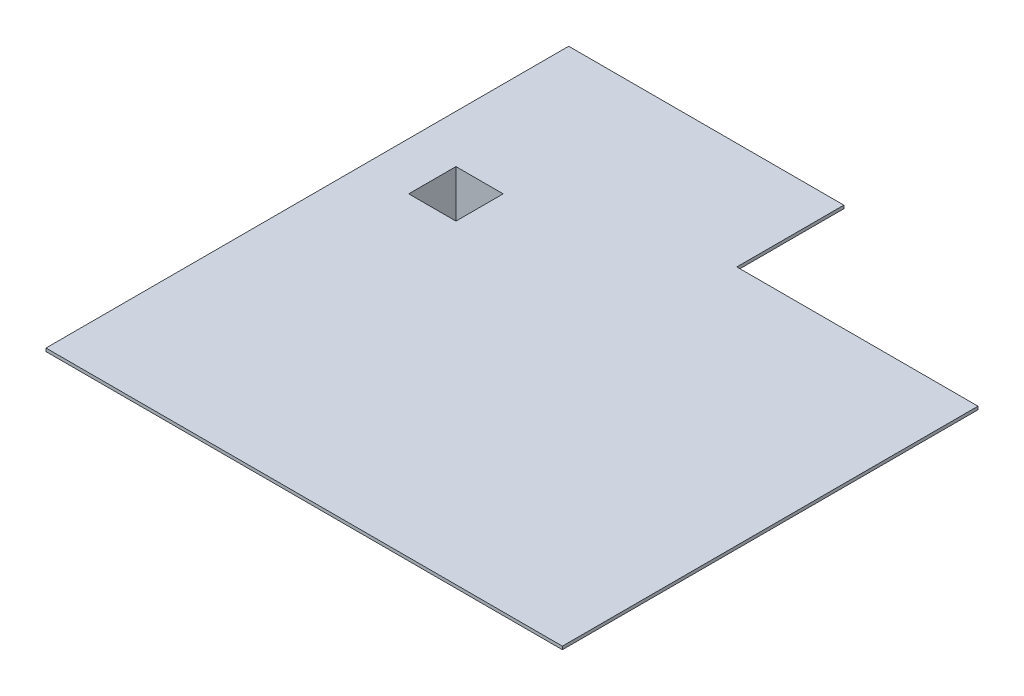
ISO-10303-21;
HEADER;
FILE_DESCRIPTION(('STEP AP214'),'2;1');
FILE_NAME('part.step','',(''),(''),'','','');
FILE_SCHEMA(('AUTOMOTIVE_DESIGN { 1 0 10303 214 1 1 1 1 }'));
ENDSEC;
DATA;
#1=APPLICATION_CONTEXT('core data for automotive mechanical design processes');
#2=APPLICATION_PROTOCOL_DEFINITION('international standard','automotive_design',2000,#1);
#3=PRODUCT_CONTEXT('',#1,'mechanical');
#4=PRODUCT('Part','Part','',(#3));
#5=PRODUCT_RELATED_PRODUCT_CATEGORY('part','',(#4));
#6=PRODUCT_DEFINITION_FORMATION('','',#4);
#7=PRODUCT_DEFINITION_CONTEXT('part definition',#1,'design');
#8=PRODUCT_DEFINITION('design','',#6,#7);
#9=PRODUCT_DEFINITION_SHAPE('','',#8);
#10=(LENGTH_UNIT() NAMED_UNIT(*) SI_UNIT(.MILLI.,.METRE.));
#11=(NAMED_UNIT(*) PLANE_ANGLE_UNIT() SI_UNIT($,.RADIAN.));
#12=(NAMED_UNIT(*) SI_UNIT($,.STERADIAN.) SOLID_ANGLE_UNIT());
#13=UNCERTAINTY_MEASURE_WITH_UNIT(LENGTH_MEASURE(1.E-05),#10,'distance_accuracy_value','');
#14=(GEOMETRIC_REPRESENTATION_CONTEXT(3) GLOBAL_UNCERTAINTY_ASSIGNED_CONTEXT((#13)) GLOBAL_UNIT_ASSIGNED_CONTEXT((#10,
#11,#12)) REPRESENTATION_CONTEXT('',''));
#15=CARTESIAN_POINT('',(0.,0.,0.));
#16=DIRECTION('',(0.,0.,1.));
#17=DIRECTION('',(1.,0.,0.));
#18=AXIS2_PLACEMENT_3D('',#15,#16,#17);
#19=CARTESIAN_POINT('',(0.,100.,0.));
#20=DIRECTION('',(1.,0.,0.));
#21=DIRECTION('',(0.,0.,-1.));
#22=AXIS2_PLACEMENT_3D('',#19,#20,#21);
#23=PLANE('',#22);
#24=DIRECTION('',(0.,0.,1.));
#25=VECTOR('',#24,1.);
#26=CARTESIAN_POINT('',(0.,0.,0.));
#27=LINE('',#26,#25);
#28=CARTESIAN_POINT('',(0.,0.,-16600.));
#29=VERTEX_POINT('',#28);
#30=CARTESIAN_POINT('',(0.,0.,0.));
#31=VERTEX_POINT('',#30);
#32=EDGE_CURVE('E212',#29,#31,#27,.T.);
#33=ORIENTED_EDGE('',*,*,#32,.T.);
#34=DIRECTION('',(0.,-1.,0.));
#35=VECTOR('',#34,1.);
#36=CARTESIAN_POINT('',(0.,100.,0.));
#37=LINE('',#36,#35);
#38=CARTESIAN_POINT('',(0.,100.,0.));
#39=VERTEX_POINT('',#38);
#40=EDGE_CURVE('E259',#39,#31,#37,.T.);
#41=ORIENTED_EDGE('',*,*,#40,.F.);
#42=DIRECTION('',(0.,0.,1.));
#43=VECTOR('',#42,1.);
#44=CARTESIAN_POINT('',(0.,100.,0.));
#45=LINE('',#44,#43);
#46=CARTESIAN_POINT('',(0.,100.,-16600.));
#47=VERTEX_POINT('',#46);
#48=EDGE_CURVE('E219',#47,#39,#45,.T.);
#49=ORIENTED_EDGE('',*,*,#48,.F.);
#50=DIRECTION('',(0.,-1.,0.));
#51=VECTOR('',#50,1.);
#52=CARTESIAN_POINT('',(0.,100.,-16600.));
#53=LINE('',#52,#51);
#54=EDGE_CURVE('E233',#47,#29,#53,.T.);
#55=ORIENTED_EDGE('',*,*,#54,.T.);
#56=EDGE_LOOP('',(#33,#41,#49,#55));
#57=FACE_BOUND('',#56,.T.);
#58=ADVANCED_FACE('F58',(#57),#23,.F.);
#59=CARTESIAN_POINT('',(0.,100.,0.));
#60=DIRECTION('',(0.,0.,-1.));
#61=DIRECTION('',(-1.,0.,0.));
#62=AXIS2_PLACEMENT_3D('',#59,#60,#61);
#63=PLANE('',#62);
#64=DIRECTION('',(1.,0.,0.));
#65=VECTOR('',#64,1.);
#66=CARTESIAN_POINT('',(0.,0.,0.));
#67=LINE('',#66,#65);
#68=CARTESIAN_POINT('',(16400.,0.,0.));
#69=VERTEX_POINT('',#68);
#70=EDGE_CURVE('E236',#31,#69,#67,.T.);
#71=ORIENTED_EDGE('',*,*,#70,.T.);
#72=DIRECTION('',(0.,-1.,0.));
#73=VECTOR('',#72,1.);
#74=CARTESIAN_POINT('',(16400.,100.,0.));
#75=LINE('',#74,#73);
#76=CARTESIAN_POINT('',(16400.,100.,0.));
#77=VERTEX_POINT('',#76);
#78=EDGE_CURVE('E256',#77,#69,#75,.T.);
#79=ORIENTED_EDGE('',*,*,#78,.F.);
#80=DIRECTION('',(1.,0.,0.));
#81=VECTOR('',#80,1.);
#82=CARTESIAN_POINT('',(0.,100.,0.));
#83=LINE('',#82,#81);
#84=EDGE_CURVE('E222',#39,#77,#83,.T.);
#85=ORIENTED_EDGE('',*,*,#84,.F.);
#86=ORIENTED_EDGE('',*,*,#40,.T.);
#87=EDGE_LOOP('',(#71,#79,#85,#86));
#88=FACE_BOUND('',#87,.T.);
#89=ADVANCED_FACE('F297',(#88),#63,.F.);
#90=CARTESIAN_POINT('',(16400.,100.,0.));
#91=DIRECTION('',(-1.,0.,0.));
#92=DIRECTION('',(0.,0.,1.));
#93=AXIS2_PLACEMENT_3D('',#90,#91,#92);
#94=PLANE('',#93);
#95=DIRECTION('',(0.,0.,-1.));
#96=VECTOR('',#95,1.);
#97=CARTESIAN_POINT('',(16400.,0.,0.));
#98=LINE('',#97,#96);
#99=CARTESIAN_POINT('',(16400.,0.,-13200.));
#100=VERTEX_POINT('',#99);
#101=EDGE_CURVE('E238',#69,#100,#98,.T.);
#102=ORIENTED_EDGE('',*,*,#101,.T.);
#103=DIRECTION('',(0.,-1.,0.));
#104=VECTOR('',#103,1.);
#105=CARTESIAN_POINT('',(16400.,100.,-13200.));
#106=LINE('',#105,#104);
#107=CARTESIAN_POINT('',(16400.,100.,-13200.));
#108=VERTEX_POINT('',#107);
#109=EDGE_CURVE('E253',#108,#100,#106,.T.);
#110=ORIENTED_EDGE('',*,*,#109,.F.);
#111=DIRECTION('',(0.,0.,-1.));
#112=VECTOR('',#111,1.);
#113=CARTESIAN_POINT('',(16400.,100.,0.));
#114=LINE('',#113,#112);
#115=EDGE_CURVE('E225',#77,#108,#114,.T.);
#116=ORIENTED_EDGE('',*,*,#115,.F.);
#117=ORIENTED_EDGE('',*,*,#78,.T.);
#118=EDGE_LOOP('',(#102,#110,#116,#117));
#119=FACE_BOUND('',#118,.T.);
#120=ADVANCED_FACE('F302',(#119),#94,.F.);
#121=CARTESIAN_POINT('',(16400.,100.,-13200.));
#122=DIRECTION('',(0.,0.,1.));
#123=DIRECTION('',(1.,0.,0.));
#124=AXIS2_PLACEMENT_3D('',#121,#122,#123);
#125=PLANE('',#124);
#126=DIRECTION('',(-1.,0.,0.));
#127=VECTOR('',#126,1.);
#128=CARTESIAN_POINT('',(16400.,0.,-13200.));
#129=LINE('',#128,#127);
#130=CARTESIAN_POINT('',(8740.,0.,-13200.));
#131=VERTEX_POINT('',#130);
#132=EDGE_CURVE('E240',#100,#131,#129,.T.);
#133=ORIENTED_EDGE('',*,*,#132,.T.);
#134=DIRECTION('',(0.,-1.,0.));
#135=VECTOR('',#134,1.);
#136=CARTESIAN_POINT('',(8740.,100.,-13200.));
#137=LINE('',#136,#135);
#138=CARTESIAN_POINT('',(8740.,100.,-13200.));
#139=VERTEX_POINT('',#138);
#140=EDGE_CURVE('E250',#139,#131,#137,.T.);
#141=ORIENTED_EDGE('',*,*,#140,.F.);
#142=DIRECTION('',(-1.,0.,0.));
#143=VECTOR('',#142,1.);
#144=CARTESIAN_POINT('',(16400.,100.,-13200.));
#145=LINE('',#144,#143);
#146=EDGE_CURVE('E227',#108,#139,#145,.T.);
#147=ORIENTED_EDGE('',*,*,#146,.F.);
#148=ORIENTED_EDGE('',*,*,#109,.T.);
#149=EDGE_LOOP('',(#133,#141,#147,#148));
#150=FACE_BOUND('',#149,.T.);
#151=ADVANCED_FACE('F323',(#150),#125,.F.);
#152=CARTESIAN_POINT('',(8740.,100.,-13200.));
#153=DIRECTION('',(-1.,0.,0.));
#154=DIRECTION('',(0.,0.,1.));
#155=AXIS2_PLACEMENT_3D('',#152,#153,#154);
#156=PLANE('',#155);
#157=DIRECTION('',(0.,0.,-1.));
#158=VECTOR('',#157,1.);
#159=CARTESIAN_POINT('',(8740.,0.,-13200.));
#160=LINE('',#159,#158);
#161=CARTESIAN_POINT('',(8740.,0.,-16600.));
#162=VERTEX_POINT('',#161);
#163=EDGE_CURVE('E242',#131,#162,#160,.T.);
#164=ORIENTED_EDGE('',*,*,#163,.T.);
#165=DIRECTION('',(0.,-1.,0.));
#166=VECTOR('',#165,1.);
#167=CARTESIAN_POINT('',(8740.,100.,-16600.));
#168=LINE('',#167,#166);
#169=CARTESIAN_POINT('',(8740.,100.,-16600.));
#170=VERTEX_POINT('',#169);
#171=EDGE_CURVE('E247',#170,#162,#168,.T.);
#172=ORIENTED_EDGE('',*,*,#171,.F.);
#173=DIRECTION('',(0.,0.,-1.));
#174=VECTOR('',#173,1.);
#175=CARTESIAN_POINT('',(8740.,100.,-13200.));
#176=LINE('',#175,#174);
#177=EDGE_CURVE('E229',#139,#170,#176,.T.);
#178=ORIENTED_EDGE('',*,*,#177,.F.);
#179=ORIENTED_EDGE('',*,*,#140,.T.);
#180=EDGE_LOOP('',(#164,#172,#178,#179));
#181=FACE_BOUND('',#180,.T.);
#182=ADVANCED_FACE('F320',(#181),#156,.F.);
#183=CARTESIAN_POINT('',(8740.,100.,-16600.));
#184=DIRECTION('',(0.,0.,1.));
#185=DIRECTION('',(1.,0.,0.));
#186=AXIS2_PLACEMENT_3D('',#183,#184,#185);
#187=PLANE('',#186);
#188=DIRECTION('',(-1.,0.,0.));
#189=VECTOR('',#188,1.);
#190=CARTESIAN_POINT('',(8740.,0.,-16600.));
#191=LINE('',#190,#189);
#192=EDGE_CURVE('E223',#162,#29,#191,.T.);
#193=ORIENTED_EDGE('',*,*,#192,.T.);
#194=ORIENTED_EDGE('',*,*,#54,.F.);
#195=DIRECTION('',(-1.,0.,0.));
#196=VECTOR('',#195,1.);
#197=CARTESIAN_POINT('',(8740.,100.,-16600.));
#198=LINE('',#197,#196);
#199=EDGE_CURVE('E231',#170,#47,#198,.T.);
#200=ORIENTED_EDGE('',*,*,#199,.F.);
#201=ORIENTED_EDGE('',*,*,#171,.T.);
#202=EDGE_LOOP('',(#193,#194,#200,#201));
#203=FACE_BOUND('',#202,.T.);
#204=ADVANCED_FACE('F318',(#203),#187,.F.);
#205=CARTESIAN_POINT('',(0.,100.,-16600.));
#206=DIRECTION('',(0.,1.,0.));
#207=DIRECTION('',(0.,0.,1.));
#208=AXIS2_PLACEMENT_3D('',#205,#206,#207);
#209=PLANE('',#208);
#210=DIRECTION('',(0.,0.,1.));
#211=VECTOR('',#210,1.);
#212=CARTESIAN_POINT('',(1520.,100.,-11500.));
#213=LINE('',#212,#211);
#214=CARTESIAN_POINT('',(1520.,100.,-11500.));
#215=VERTEX_POINT('',#214);
#216=CARTESIAN_POINT('',(1520.,100.,-10000.));
#217=VERTEX_POINT('',#216);
#218=EDGE_CURVE('E174',#215,#217,#213,.T.);
#219=ORIENTED_EDGE('',*,*,#218,.F.);
#220=DIRECTION('',(-1.,0.,0.));
#221=VECTOR('',#220,1.);
#222=CARTESIAN_POINT('',(1520.,100.,-11500.));
#223=LINE('',#222,#221);
#224=CARTESIAN_POINT('',(3020.,100.,-11500.));
#225=VERTEX_POINT('',#224);
#226=EDGE_CURVE('E179',#225,#215,#223,.T.);
#227=ORIENTED_EDGE('',*,*,#226,.F.);
#228=DIRECTION('',(0.,0.,-1.));
#229=VECTOR('',#228,1.);
#230=CARTESIAN_POINT('',(3020.,100.,-11500.));
#231=LINE('',#230,#229);
#232=CARTESIAN_POINT('',(3020.,100.,-10000.));
#233=VERTEX_POINT('',#232);
#234=EDGE_CURVE('E162',#233,#225,#231,.T.);
#235=ORIENTED_EDGE('',*,*,#234,.F.);
#236=DIRECTION('',(1.,0.,0.));
#237=VECTOR('',#236,1.);
#238=CARTESIAN_POINT('',(1520.,100.,-10000.));
#239=LINE('',#238,#237);
#240=EDGE_CURVE('E170',#217,#233,#239,.T.);
#241=ORIENTED_EDGE('',*,*,#240,.F.);
#242=EDGE_LOOP('',(#219,#227,#235,#241));
#243=FACE_BOUND('',#242,.T.);
#244=ORIENTED_EDGE('',*,*,#48,.T.);
#245=ORIENTED_EDGE('',*,*,#84,.T.);
#246=ORIENTED_EDGE('',*,*,#115,.T.);
#247=ORIENTED_EDGE('',*,*,#146,.T.);
#248=ORIENTED_EDGE('',*,*,#177,.T.);
#249=ORIENTED_EDGE('',*,*,#199,.T.);
#250=EDGE_LOOP('',(#244,#245,#246,#247,#248,#249));
#251=FACE_BOUND('',#250,.T.);
#252=ADVANCED_FACE('F176',(#243,#251),#209,.T.);
#253=CARTESIAN_POINT('',(0.,0.,-16600.));
#254=DIRECTION('',(0.,1.,0.));
#255=DIRECTION('',(0.,0.,1.));
#256=AXIS2_PLACEMENT_3D('',#253,#254,#255);
#257=PLANE('',#256);
#258=DIRECTION('',(-1.,0.,0.));
#259=VECTOR('',#258,1.);
#260=CARTESIAN_POINT('',(0.,0.,-11600.));
#261=LINE('',#260,#259);
#262=CARTESIAN_POINT('',(3120.,0.,-11600.));
#263=VERTEX_POINT('',#262);
#264=CARTESIAN_POINT('',(1420.,0.,-11600.));
#265=VERTEX_POINT('',#264);
#266=EDGE_CURVE('E65',#263,#265,#261,.T.);
#267=ORIENTED_EDGE('',*,*,#266,.T.);
#268=DIRECTION('',(0.,0.,1.));
#269=VECTOR('',#268,1.);
#270=CARTESIAN_POINT('',(1420.,0.,-16600.));
#271=LINE('',#270,#269);
#272=CARTESIAN_POINT('',(1420.,0.,-9900.));
#273=VERTEX_POINT('',#272);
#274=EDGE_CURVE('E12',#265,#273,#271,.T.);
#275=ORIENTED_EDGE('',*,*,#274,.T.);
#276=DIRECTION('',(1.,0.,0.));
#277=VECTOR('',#276,1.);
#278=CARTESIAN_POINT('',(0.,0.,-9900.));
#279=LINE('',#278,#277);
#280=CARTESIAN_POINT('',(3120.,0.,-9900.));
#281=VERTEX_POINT('',#280);
#282=EDGE_CURVE('E262',#273,#281,#279,.T.);
#283=ORIENTED_EDGE('',*,*,#282,.T.);
#284=DIRECTION('',(0.,0.,-1.));
#285=VECTOR('',#284,1.);
#286=CARTESIAN_POINT('',(3120.,0.,-16600.));
#287=LINE('',#286,#285);
#288=EDGE_CURVE('E265',#281,#263,#287,.T.);
#289=ORIENTED_EDGE('',*,*,#288,.T.);
#290=EDGE_LOOP('',(#267,#275,#283,#289));
#291=FACE_BOUND('',#290,.T.);
#292=ORIENTED_EDGE('',*,*,#32,.F.);
#293=ORIENTED_EDGE('',*,*,#192,.F.);
#294=ORIENTED_EDGE('',*,*,#163,.F.);
#295=ORIENTED_EDGE('',*,*,#132,.F.);
#296=ORIENTED_EDGE('',*,*,#101,.F.);
#297=ORIENTED_EDGE('',*,*,#70,.F.);
#298=EDGE_LOOP('',(#292,#293,#294,#295,#296,#297));
#299=FACE_BOUND('',#298,.T.);
#300=ADVANCED_FACE('F269',(#291,#299),#257,.F.);
#301=CARTESIAN_POINT('',(1420.,-2100.,-11500.));
#302=DIRECTION('',(-1.,0.,0.));
#303=DIRECTION('',(0.,0.,1.));
#304=AXIS2_PLACEMENT_3D('',#301,#302,#303);
#305=PLANE('',#304);
#306=ORIENTED_EDGE('',*,*,#274,.F.);
#307=DIRECTION('',(0.,1.,0.));
#308=VECTOR('',#307,1.);
#309=CARTESIAN_POINT('',(1420.,-2100.,-11600.));
#310=LINE('',#309,#308);
#311=CARTESIAN_POINT('',(1420.,-2100.,-11600.));
#312=VERTEX_POINT('',#311);
#313=EDGE_CURVE('E209',#312,#265,#310,.T.);
#314=ORIENTED_EDGE('',*,*,#313,.F.);
#315=DIRECTION('',(0.,0.,1.));
#316=VECTOR('',#315,1.);
#317=CARTESIAN_POINT('',(1420.,-2100.,-11500.));
#318=LINE('',#317,#316);
#319=CARTESIAN_POINT('',(1420.,-2100.,-9900.));
#320=VERTEX_POINT('',#319);
#321=EDGE_CURVE('E195',#312,#320,#318,.T.);
#322=ORIENTED_EDGE('',*,*,#321,.T.);
#323=DIRECTION('',(0.,1.,0.));
#324=VECTOR('',#323,1.);
#325=CARTESIAN_POINT('',(1420.,-2100.,-9900.));
#326=LINE('',#325,#324);
#327=EDGE_CURVE('E208',#320,#273,#326,.T.);
#328=ORIENTED_EDGE('',*,*,#327,.T.);
#329=EDGE_LOOP('',(#306,#314,#322,#328));
#330=FACE_BOUND('',#329,.T.);
#331=ADVANCED_FACE('F282',(#330),#305,.T.);
#332=CARTESIAN_POINT('',(1520.,-2100.,-11600.));
#333=DIRECTION('',(0.,0.,-1.));
#334=DIRECTION('',(-1.,0.,0.));
#335=AXIS2_PLACEMENT_3D('',#332,#333,#334);
#336=PLANE('',#335);
#337=ORIENTED_EDGE('',*,*,#266,.F.);
#338=DIRECTION('',(0.,1.,0.));
#339=VECTOR('',#338,1.);
#340=CARTESIAN_POINT('',(3120.,-2100.,-11600.));
#341=LINE('',#340,#339);
#342=CARTESIAN_POINT('',(3120.,-2100.,-11600.));
#343=VERTEX_POINT('',#342);
#344=EDGE_CURVE('E213',#343,#263,#341,.T.);
#345=ORIENTED_EDGE('',*,*,#344,.F.);
#346=DIRECTION('',(-1.,0.,0.));
#347=VECTOR('',#346,1.);
#348=CARTESIAN_POINT('',(1520.,-2100.,-11600.));
#349=LINE('',#348,#347);
#350=EDGE_CURVE('E205',#343,#312,#349,.T.);
#351=ORIENTED_EDGE('',*,*,#350,.T.);
#352=ORIENTED_EDGE('',*,*,#313,.T.);
#353=EDGE_LOOP('',(#337,#345,#351,#352));
#354=FACE_BOUND('',#353,.T.);
#355=ADVANCED_FACE('F272',(#354),#336,.T.);
#356=CARTESIAN_POINT('',(3120.,-2100.,-11500.));
#357=DIRECTION('',(1.,0.,0.));
#358=DIRECTION('',(0.,0.,-1.));
#359=AXIS2_PLACEMENT_3D('',#356,#357,#358);
#360=PLANE('',#359);
#361=ORIENTED_EDGE('',*,*,#288,.F.);
#362=DIRECTION('',(0.,1.,0.));
#363=VECTOR('',#362,1.);
#364=CARTESIAN_POINT('',(3120.,-2100.,-9900.));
#365=LINE('',#364,#363);
#366=CARTESIAN_POINT('',(3120.,-2100.,-9900.));
#367=VERTEX_POINT('',#366);
#368=EDGE_CURVE('E80',#367,#281,#365,.T.);
#369=ORIENTED_EDGE('',*,*,#368,.F.);
#370=DIRECTION('',(0.,0.,-1.));
#371=VECTOR('',#370,1.);
#372=CARTESIAN_POINT('',(3120.,-2100.,-11500.));
#373=LINE('',#372,#371);
#374=EDGE_CURVE('E202',#367,#343,#373,.T.);
#375=ORIENTED_EDGE('',*,*,#374,.T.);
#376=ORIENTED_EDGE('',*,*,#344,.T.);
#377=EDGE_LOOP('',(#361,#369,#375,#376));
#378=FACE_BOUND('',#377,.T.);
#379=ADVANCED_FACE('F274',(#378),#360,.T.);
#380=CARTESIAN_POINT('',(1520.,-2100.,-9900.));
#381=DIRECTION('',(0.,0.,1.));
#382=DIRECTION('',(1.,0.,0.));
#383=AXIS2_PLACEMENT_3D('',#380,#381,#382);
#384=PLANE('',#383);
#385=ORIENTED_EDGE('',*,*,#282,.F.);
#386=ORIENTED_EDGE('',*,*,#327,.F.);
#387=DIRECTION('',(1.,0.,0.));
#388=VECTOR('',#387,1.);
#389=CARTESIAN_POINT('',(1520.,-2100.,-9900.));
#390=LINE('',#389,#388);
#391=EDGE_CURVE('E200',#320,#367,#390,.T.);
#392=ORIENTED_EDGE('',*,*,#391,.T.);
#393=ORIENTED_EDGE('',*,*,#368,.T.);
#394=EDGE_LOOP('',(#385,#386,#392,#393));
#395=FACE_BOUND('',#394,.T.);
#396=ADVANCED_FACE('F283',(#395),#384,.T.);
#397=CARTESIAN_POINT('',(1520.,-2100.,-11500.));
#398=DIRECTION('',(-1.,0.,0.));
#399=DIRECTION('',(0.,0.,1.));
#400=AXIS2_PLACEMENT_3D('',#397,#398,#399);
#401=PLANE('',#400);
#402=DIRECTION('',(0.,1.,0.));
#403=VECTOR('',#402,1.);
#404=CARTESIAN_POINT('',(1520.,-2100.,-11500.));
#405=LINE('',#404,#403);
#406=CARTESIAN_POINT('',(1520.,-2100.,-11500.));
#407=VERTEX_POINT('',#406);
#408=EDGE_CURVE('E193',#407,#215,#405,.T.);
#409=ORIENTED_EDGE('',*,*,#408,.T.);
#410=ORIENTED_EDGE('',*,*,#218,.T.);
#411=DIRECTION('',(0.,1.,0.));
#412=VECTOR('',#411,1.);
#413=CARTESIAN_POINT('',(1520.,-2100.,-10000.));
#414=LINE('',#413,#412);
#415=CARTESIAN_POINT('',(1520.,-2100.,-10000.));
#416=VERTEX_POINT('',#415);
#417=EDGE_CURVE('E72',#416,#217,#414,.T.);
#418=ORIENTED_EDGE('',*,*,#417,.F.);
#419=DIRECTION('',(0.,0.,1.));
#420=VECTOR('',#419,1.);
#421=CARTESIAN_POINT('',(1520.,-2100.,-11500.));
#422=LINE('',#421,#420);
#423=EDGE_CURVE('E181',#407,#416,#422,.T.);
#424=ORIENTED_EDGE('',*,*,#423,.F.);
#425=EDGE_LOOP('',(#409,#410,#418,#424));
#426=FACE_BOUND('',#425,.T.);
#427=ADVANCED_FACE('F285',(#426),#401,.F.);
#428=CARTESIAN_POINT('',(1520.,-2100.,-11500.));
#429=DIRECTION('',(0.,0.,-1.));
#430=DIRECTION('',(-1.,0.,0.));
#431=AXIS2_PLACEMENT_3D('',#428,#429,#430);
#432=PLANE('',#431);
#433=DIRECTION('',(0.,1.,0.));
#434=VECTOR('',#433,1.);
#435=CARTESIAN_POINT('',(3020.,-2100.,-11500.));
#436=LINE('',#435,#434);
#437=CARTESIAN_POINT('',(3020.,-2100.,-11500.));
#438=VERTEX_POINT('',#437);
#439=EDGE_CURVE('E167',#438,#225,#436,.T.);
#440=ORIENTED_EDGE('',*,*,#439,.T.);
#441=ORIENTED_EDGE('',*,*,#226,.T.);
#442=ORIENTED_EDGE('',*,*,#408,.F.);
#443=DIRECTION('',(-1.,0.,0.));
#444=VECTOR('',#443,1.);
#445=CARTESIAN_POINT('',(1520.,-2100.,-11500.));
#446=LINE('',#445,#444);
#447=EDGE_CURVE('E190',#438,#407,#446,.T.);
#448=ORIENTED_EDGE('',*,*,#447,.F.);
#449=EDGE_LOOP('',(#440,#441,#442,#448));
#450=FACE_BOUND('',#449,.T.);
#451=ADVANCED_FACE('F291',(#450),#432,.F.);
#452=CARTESIAN_POINT('',(3020.,-2100.,-11500.));
#453=DIRECTION('',(1.,0.,0.));
#454=DIRECTION('',(0.,0.,-1.));
#455=AXIS2_PLACEMENT_3D('',#452,#453,#454);
#456=PLANE('',#455);
#457=DIRECTION('',(0.,1.,0.));
#458=VECTOR('',#457,1.);
#459=CARTESIAN_POINT('',(3020.,-2100.,-10000.));
#460=LINE('',#459,#458);
#461=CARTESIAN_POINT('',(3020.,-2100.,-10000.));
#462=VERTEX_POINT('',#461);
#463=EDGE_CURVE('E159',#462,#233,#460,.T.);
#464=ORIENTED_EDGE('',*,*,#463,.T.);
#465=ORIENTED_EDGE('',*,*,#234,.T.);
#466=ORIENTED_EDGE('',*,*,#439,.F.);
#467=DIRECTION('',(0.,0.,-1.));
#468=VECTOR('',#467,1.);
#469=CARTESIAN_POINT('',(3020.,-2100.,-11500.));
#470=LINE('',#469,#468);
#471=EDGE_CURVE('E165',#462,#438,#470,.T.);
#472=ORIENTED_EDGE('',*,*,#471,.F.);
#473=EDGE_LOOP('',(#464,#465,#466,#472));
#474=FACE_BOUND('',#473,.T.);
#475=ADVANCED_FACE('F160',(#474),#456,.F.);
#476=CARTESIAN_POINT('',(1520.,-2100.,-10000.));
#477=DIRECTION('',(0.,0.,1.));
#478=DIRECTION('',(1.,0.,0.));
#479=AXIS2_PLACEMENT_3D('',#476,#477,#478);
#480=PLANE('',#479);
#481=ORIENTED_EDGE('',*,*,#417,.T.);
#482=ORIENTED_EDGE('',*,*,#240,.T.);
#483=ORIENTED_EDGE('',*,*,#463,.F.);
#484=DIRECTION('',(1.,0.,0.));
#485=VECTOR('',#484,1.);
#486=CARTESIAN_POINT('',(1520.,-2100.,-10000.));
#487=LINE('',#486,#485);
#488=EDGE_CURVE('E187',#416,#462,#487,.T.);
#489=ORIENTED_EDGE('',*,*,#488,.F.);
#490=EDGE_LOOP('',(#481,#482,#483,#489));
#491=FACE_BOUND('',#490,.T.);
#492=ADVANCED_FACE('F171',(#491),#480,.F.);
#493=CARTESIAN_POINT('',(1420.,-2100.,-9900.));
#494=DIRECTION('',(0.,1.,0.));
#495=DIRECTION('',(0.,0.,1.));
#496=AXIS2_PLACEMENT_3D('',#493,#494,#495);
#497=PLANE('',#496);
#498=ORIENTED_EDGE('',*,*,#447,.T.);
#499=ORIENTED_EDGE('',*,*,#423,.T.);
#500=ORIENTED_EDGE('',*,*,#488,.T.);
#501=ORIENTED_EDGE('',*,*,#471,.T.);
#502=EDGE_LOOP('',(#498,#499,#500,#501));
#503=FACE_BOUND('',#502,.T.);
#504=ORIENTED_EDGE('',*,*,#321,.F.);
#505=ORIENTED_EDGE('',*,*,#350,.F.);
#506=ORIENTED_EDGE('',*,*,#374,.F.);
#507=ORIENTED_EDGE('',*,*,#391,.F.);
#508=EDGE_LOOP('',(#504,#505,#506,#507));
#509=FACE_BOUND('',#508,.T.);
#510=ADVANCED_FACE('F280',(#503,#509),#497,.F.);
#511=CLOSED_SHELL('',(#58,#89,#120,#151,#182,#204,#252,#300,#331,#355,#379,#396,#427,#451,#475,
#492,#510));
#512=MANIFOLD_SOLID_BREP('B2',#511);
#513=ADVANCED_BREP_SHAPE_REPRESENTATION('',(#18,#512),#14);
#514=SHAPE_DEFINITION_REPRESENTATION(#9,#513);
ENDSEC;
END-ISO-10303-21;
